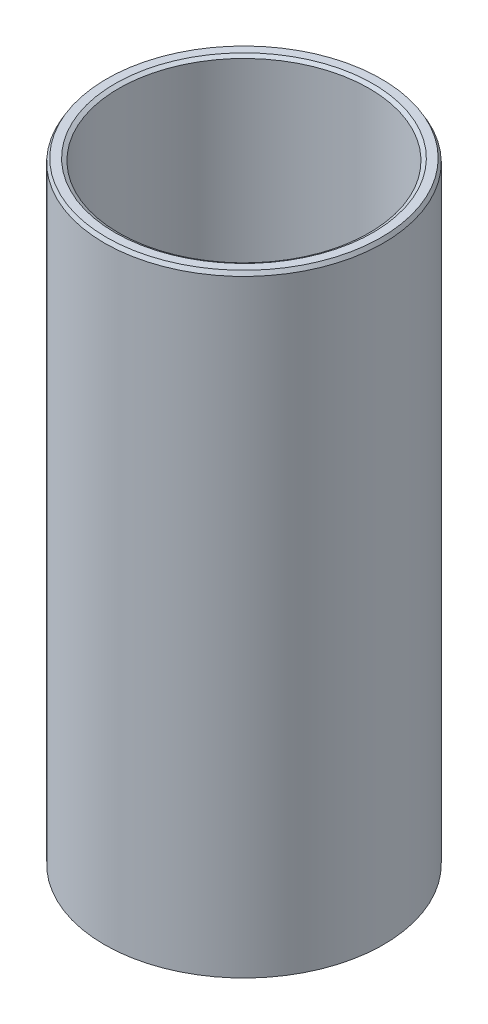
ISO-10303-21;
HEADER;
FILE_DESCRIPTION(('STEP AP214'),'2;1');
FILE_NAME('part.step','',(''),(''),'','','');
FILE_SCHEMA(('AUTOMOTIVE_DESIGN { 1 0 10303 214 1 1 1 1 }'));
ENDSEC;
DATA;
#1=APPLICATION_CONTEXT('core data for automotive mechanical design processes');
#2=APPLICATION_PROTOCOL_DEFINITION('international standard','automotive_design',2000,#1);
#3=PRODUCT_CONTEXT('',#1,'mechanical');
#4=PRODUCT('Part','Part','',(#3));
#5=PRODUCT_RELATED_PRODUCT_CATEGORY('part','',(#4));
#6=PRODUCT_DEFINITION_FORMATION('','',#4);
#7=PRODUCT_DEFINITION_CONTEXT('part definition',#1,'design');
#8=PRODUCT_DEFINITION('design','',#6,#7);
#9=PRODUCT_DEFINITION_SHAPE('','',#8);
#10=(LENGTH_UNIT() NAMED_UNIT(*) SI_UNIT(.MILLI.,.METRE.));
#11=(NAMED_UNIT(*) PLANE_ANGLE_UNIT() SI_UNIT($,.RADIAN.));
#12=(NAMED_UNIT(*) SI_UNIT($,.STERADIAN.) SOLID_ANGLE_UNIT());
#13=UNCERTAINTY_MEASURE_WITH_UNIT(LENGTH_MEASURE(1.E-05),#10,'distance_accuracy_value','');
#14=(GEOMETRIC_REPRESENTATION_CONTEXT(3) GLOBAL_UNCERTAINTY_ASSIGNED_CONTEXT((#13)) GLOBAL_UNIT_ASSIGNED_CONTEXT((#10,
#11,#12)) REPRESENTATION_CONTEXT('',''));
#15=CARTESIAN_POINT('',(0.,0.,0.));
#16=DIRECTION('',(0.,0.,1.));
#17=DIRECTION('',(1.,0.,0.));
#18=AXIS2_PLACEMENT_3D('',#15,#16,#17);
#19=CARTESIAN_POINT('',(0.,219.86373362812,0.));
#20=DIRECTION('',(0.,-1.,0.));
#21=DIRECTION('',(0.,0.,-1.));
#22=AXIS2_PLACEMENT_3D('',#19,#20,#21);
#23=CYLINDRICAL_SURFACE('',#22,50.);
#24=CARTESIAN_POINT('',(0.,0.782832684059431,0.));
#25=DIRECTION('',(0.,1.,0.));
#26=DIRECTION('',(0.,0.,1.));
#27=AXIS2_PLACEMENT_3D('',#24,#25,#26);
#28=CIRCLE('',#27,50.);
#29=CARTESIAN_POINT('',(0.,0.782832684059431,50.));
#30=VERTEX_POINT('',#29);
#31=EDGE_CURVE('E10',#30,#30,#28,.T.);
#32=ORIENTED_EDGE('',*,*,#31,.T.);
#33=EDGE_LOOP('',(#32));
#34=FACE_BOUND('',#33,.T.);
#35=CARTESIAN_POINT('',(0.,218.507827645504,0.));
#36=DIRECTION('',(0.,1.,0.));
#37=DIRECTION('',(0.,0.,1.));
#38=AXIS2_PLACEMENT_3D('',#35,#36,#37);
#39=CIRCLE('',#38,50.);
#40=CARTESIAN_POINT('',(0.,218.507827645504,50.));
#41=VERTEX_POINT('',#40);
#42=EDGE_CURVE('E50',#41,#41,#39,.F.);
#43=ORIENTED_EDGE('',*,*,#42,.T.);
#44=EDGE_LOOP('',(#43));
#45=FACE_BOUND('',#44,.T.);
#46=ADVANCED_FACE('F39',(#34,#45),#23,.T.);
#47=CARTESIAN_POINT('',(0.,219.86373362812,0.));
#48=DIRECTION('',(0.,1.,0.));
#49=DIRECTION('',(0.,0.,1.));
#50=AXIS2_PLACEMENT_3D('',#47,#48,#49);
#51=PLANE('',#50);
#52=CARTESIAN_POINT('',(0.,219.86373362812,0.));
#53=DIRECTION('',(0.,1.,0.));
#54=DIRECTION('',(0.,0.,1.));
#55=AXIS2_PLACEMENT_3D('',#52,#53,#54);
#56=CIRCLE('',#55,46.2211691795901);
#57=CARTESIAN_POINT('',(0.,219.86373362812,46.2211691795901));
#58=VERTEX_POINT('',#57);
#59=EDGE_CURVE('E58',#58,#58,#56,.F.);
#60=ORIENTED_EDGE('',*,*,#59,.T.);
#61=EDGE_LOOP('',(#60));
#62=FACE_BOUND('',#61,.T.);
#63=CARTESIAN_POINT('',(0.,219.86373362812,0.));
#64=DIRECTION('',(0.,1.,0.));
#65=DIRECTION('',(0.,0.,1.));
#66=AXIS2_PLACEMENT_3D('',#63,#64,#65);
#67=CIRCLE('',#66,49.2171673159406);
#68=CARTESIAN_POINT('',(0.,219.86373362812,49.2171673159406));
#69=VERTEX_POINT('',#68);
#70=EDGE_CURVE('E61',#69,#69,#67,.T.);
#71=ORIENTED_EDGE('',*,*,#70,.T.);
#72=EDGE_LOOP('',(#71));
#73=FACE_BOUND('',#72,.T.);
#74=ADVANCED_FACE('F88',(#62,#73),#51,.T.);
#75=CARTESIAN_POINT('',(0.,0.,0.));
#76=DIRECTION('',(0.,1.,0.));
#77=DIRECTION('',(0.,0.,1.));
#78=AXIS2_PLACEMENT_3D('',#75,#76,#77);
#79=PLANE('',#78);
#80=CARTESIAN_POINT('',(0.,0.,0.));
#81=DIRECTION('',(0.,1.,0.));
#82=DIRECTION('',(0.,0.,1.));
#83=AXIS2_PLACEMENT_3D('',#80,#81,#82);
#84=CIRCLE('',#83,45.6480958810332);
#85=CARTESIAN_POINT('',(0.,0.,-45.6480958810332));
#86=VERTEX_POINT('',#85);
#87=EDGE_CURVE('E51',#86,#86,#84,.T.);
#88=ORIENTED_EDGE('',*,*,#87,.T.);
#89=EDGE_LOOP('',(#88));
#90=FACE_BOUND('',#89,.T.);
#91=CARTESIAN_POINT('',(0.,0.,0.));
#92=DIRECTION('',(0.,1.,0.));
#93=DIRECTION('',(0.,0.,1.));
#94=AXIS2_PLACEMENT_3D('',#91,#92,#93);
#95=CIRCLE('',#94,48.6440940173836);
#96=CARTESIAN_POINT('',(0.,0.,48.6440940173836));
#97=VERTEX_POINT('',#96);
#98=EDGE_CURVE('E54',#97,#97,#95,.F.);
#99=ORIENTED_EDGE('',*,*,#98,.T.);
#100=EDGE_LOOP('',(#99));
#101=FACE_BOUND('',#100,.T.);
#102=ADVANCED_FACE('F83',(#90,#101),#79,.F.);
#103=CARTESIAN_POINT('',(0.,219.86373362812,0.));
#104=DIRECTION('',(0.,-1.,0.));
#105=DIRECTION('',(0.,0.,-1.));
#106=AXIS2_PLACEMENT_3D('',#103,#104,#105);
#107=CYLINDRICAL_SURFACE('',#106,44.8652631969738);
#108=CARTESIAN_POINT('',(0.,219.080900944061,0.));
#109=DIRECTION('',(0.,1.,0.));
#110=DIRECTION('',(0.,0.,1.));
#111=AXIS2_PLACEMENT_3D('',#108,#109,#110);
#112=CIRCLE('',#111,44.8652631969738);
#113=CARTESIAN_POINT('',(0.,219.080900944061,44.8652631969738));
#114=VERTEX_POINT('',#113);
#115=EDGE_CURVE('E67',#114,#114,#112,.T.);
#116=ORIENTED_EDGE('',*,*,#115,.T.);
#117=EDGE_LOOP('',(#116));
#118=FACE_BOUND('',#117,.T.);
#119=CARTESIAN_POINT('',(0.,1.35590598261637,0.));
#120=DIRECTION('',(0.,1.,0.));
#121=DIRECTION('',(0.,0.,1.));
#122=AXIS2_PLACEMENT_3D('',#119,#120,#121);
#123=CIRCLE('',#122,44.8652631969738);
#124=CARTESIAN_POINT('',(0.,1.35590598261637,-44.8652631969738));
#125=VERTEX_POINT('',#124);
#126=EDGE_CURVE('E69',#125,#125,#123,.F.);
#127=ORIENTED_EDGE('',*,*,#126,.T.);
#128=EDGE_LOOP('',(#127));
#129=FACE_BOUND('',#128,.T.);
#130=ADVANCED_FACE('F71',(#118,#129),#107,.F.);
#131=CARTESIAN_POINT('',(0.,219.080900944061,0.));
#132=DIRECTION('',(0.,1.,0.));
#133=DIRECTION('',(0.,0.,1.));
#134=AXIS2_PLACEMENT_3D('',#131,#132,#133);
#135=CONICAL_SURFACE('',#134,44.8652631969738,1.04719755119659);
#136=ORIENTED_EDGE('',*,*,#59,.F.);
#137=EDGE_LOOP('',(#136));
#138=FACE_BOUND('',#137,.T.);
#139=ORIENTED_EDGE('',*,*,#115,.F.);
#140=EDGE_LOOP('',(#139));
#141=FACE_BOUND('',#140,.T.);
#142=ADVANCED_FACE('F77',(#138,#141),#135,.F.);
#143=CARTESIAN_POINT('',(0.,0.,0.));
#144=DIRECTION('',(0.,-1.,0.));
#145=DIRECTION('',(0.,0.,-1.));
#146=AXIS2_PLACEMENT_3D('',#143,#144,#145);
#147=CONICAL_SURFACE('',#146,45.6480958810332,0.523598775598298);
#148=CARTESIAN_POINT('',(0.,1.35590598261637,-44.8652631969738));
#149=CARTESIAN_POINT('',(0.,1.34178196196411,-44.8734177040994));
#150=CARTESIAN_POINT('',(0.,1.32765794131186,-44.881572211225));
#151=CARTESIAN_POINT('',(0.,1.29940990000735,-44.8978812254763));
#152=CARTESIAN_POINT('',(0.,1.2852858793551,-44.9060357326019));
#153=CARTESIAN_POINT('',(0.,1.25703783805059,-44.9223447468531));
#154=CARTESIAN_POINT('',(0.,1.24291381739834,-44.9304992539787));
#155=CARTESIAN_POINT('',(0.,1.21466577609383,-44.94680826823));
#156=CARTESIAN_POINT('',(0.,1.20054175544158,-44.9549627753556));
#157=CARTESIAN_POINT('',(0.,1.17229371413707,-44.9712717896068));
#158=CARTESIAN_POINT('',(0.,1.15816969348481,-44.9794262967325));
#159=CARTESIAN_POINT('',(0.,1.12992165218031,-44.9957353109837));
#160=CARTESIAN_POINT('',(0.,1.11579763152805,-45.0038898181093));
#161=CARTESIAN_POINT('',(0.,1.08754959022355,-45.0201988323606));
#162=CARTESIAN_POINT('',(0.,1.07342556957129,-45.0283533394862));
#163=CARTESIAN_POINT('',(0.,1.04517752826678,-45.0446623537374));
#164=CARTESIAN_POINT('',(0.,1.03105350761453,-45.052816860863));
#165=CARTESIAN_POINT('',(0.,1.00280546631002,-45.0691258751143));
#166=CARTESIAN_POINT('',(0.,0.988681445657768,-45.0772803822399));
#167=CARTESIAN_POINT('',(0.,0.960433404353261,-45.0935893964911));
#168=CARTESIAN_POINT('',(0.,0.946309383701007,-45.1017439036167));
#169=CARTESIAN_POINT('',(0.,0.918061342396499,-45.118052917868));
#170=CARTESIAN_POINT('',(0.,0.903937321744245,-45.1262074249936));
#171=CARTESIAN_POINT('',(0.,0.875689280439737,-45.1425164392448));
#172=CARTESIAN_POINT('',(0.,0.861565259787483,-45.1506709463704));
#173=CARTESIAN_POINT('',(0.,0.833317218482975,-45.1669799606217));
#174=CARTESIAN_POINT('',(0.,0.819193197830722,-45.1751344677473));
#175=CARTESIAN_POINT('',(0.,0.790945156526215,-45.1914434819985));
#176=CARTESIAN_POINT('',(0.,0.776821135873961,-45.1995979891242));
#177=CARTESIAN_POINT('',(0.,0.748573094569453,-45.2159070033754));
#178=CARTESIAN_POINT('',(0.,0.734449073917198,-45.224061510501));
#179=CARTESIAN_POINT('',(0.,0.706201032612691,-45.2403705247523));
#180=CARTESIAN_POINT('',(0.,0.692077011960438,-45.2485250318779));
#181=CARTESIAN_POINT('',(0.,0.66382897065593,-45.2648340461291));
#182=CARTESIAN_POINT('',(0.,0.649704950003676,-45.2729885532547));
#183=CARTESIAN_POINT('',(0.,0.621456908699168,-45.289297567506));
#184=CARTESIAN_POINT('',(0.,0.607332888046915,-45.2974520746316));
#185=CARTESIAN_POINT('',(0.,0.579084846742407,-45.3137610888828));
#186=CARTESIAN_POINT('',(0.,0.564960826090153,-45.3219155960084));
#187=CARTESIAN_POINT('',(0.,0.536712784785645,-45.3382246102597));
#188=CARTESIAN_POINT('',(0.,0.522588764133392,-45.3463791173853));
#189=CARTESIAN_POINT('',(0.,0.494340722828885,-45.3626881316365));
#190=CARTESIAN_POINT('',(0.,0.48021670217663,-45.3708426387621));
#191=CARTESIAN_POINT('',(0.,0.451968660872122,-45.3871516530134));
#192=CARTESIAN_POINT('',(0.,0.437844640219869,-45.395306160139));
#193=CARTESIAN_POINT('',(0.,0.409596598915361,-45.4116151743902));
#194=CARTESIAN_POINT('',(0.,0.395472578263107,-45.4197696815159));
#195=CARTESIAN_POINT('',(0.,0.367224536958599,-45.4360786957671));
#196=CARTESIAN_POINT('',(0.,0.353100516306346,-45.4442332028927));
#197=CARTESIAN_POINT('',(0.,0.324852475001839,-45.460542217144));
#198=CARTESIAN_POINT('',(0.,0.310728454349585,-45.4686967242696));
#199=CARTESIAN_POINT('',(0.,0.282480413045076,-45.4850057385208));
#200=CARTESIAN_POINT('',(0.,0.268356392392822,-45.4931602456464));
#201=CARTESIAN_POINT('',(0.,0.240108351088315,-45.5094692598977));
#202=CARTESIAN_POINT('',(0.,0.225984330436062,-45.5176237670233));
#203=CARTESIAN_POINT('',(0.,0.197736289131554,-45.5339327812745));
#204=CARTESIAN_POINT('',(0.,0.1836122684793,-45.5420872884001));
#205=CARTESIAN_POINT('',(0.,0.155364227174792,-45.5583963026514));
#206=CARTESIAN_POINT('',(0.,0.141240206522538,-45.566550809777));
#207=CARTESIAN_POINT('',(0.,0.112992165218031,-45.5828598240282));
#208=CARTESIAN_POINT('',(0.,0.0988681445657763,-45.5910143311538));
#209=CARTESIAN_POINT('',(0.,0.0706201032612687,-45.6073233454051));
#210=CARTESIAN_POINT('',(0.,0.0564960826090153,-45.6154778525307));
#211=CARTESIAN_POINT('',(0.,0.0282480413045086,-45.6317868667819));
#212=CARTESIAN_POINT('',(0.,0.0141240206522553,-45.6399413739076));
#213=CARTESIAN_POINT('',(0.,0.,-45.6480958810332));
#214=B_SPLINE_CURVE_WITH_KNOTS('',3,(#148,#149,#150,#151,#152,#153,#154,#155,#156,#157,#158,
#159,#160,#161,#162,#163,#164,#165,#166,#167,#168,#169,#170,#171,#172,#173,#174,#175,#176,#177,
#178,#179,#180,#181,#182,#183,#184,#185,#186,#187,#188,#189,#190,#191,#192,#193,#194,#195,#196,
#197,#198,#199,#200,#201,#202,#203,#204,#205,#206,#207,#208,#209,#210,#211,#212,#213),
.UNSPECIFIED.,.F.,.F.,(4,2,2,2,2,2,2,2,2,2,2,2,2,2,2,2,2,2,2,2,2,2,2,2,2,2,2,2,2,2,2,2,4),(0.,
0.0489270427537105,0.0978540855074245,0.146781128261135,0.195708171014845,0.244635213768556,
0.29356225652227,0.34248929927598,0.391416342029691,0.440343384783405,0.489270427537115,
0.538197470290826,0.587124513044536,0.63605155579825,0.684978598551961,0.733905641305671,
0.782832684059386,0.831759726813096,0.880686769566807,0.929613812320517,0.978540855074231,
1.02746789782794,1.07639494058165,1.12532198333536,1.17424902608908,1.22317606884279,
1.2721031115965,1.32103015435021,1.36995719710392,1.41888423985763,1.46781128261134,
1.51673832536506,1.56566536811877),.UNSPECIFIED.);
#215=EDGE_CURVE('BSEAM73',#125,#86,#214,.T.);
#216=ORIENTED_EDGE('',*,*,#126,.F.);
#217=ORIENTED_EDGE('',*,*,#87,.F.);
#218=ORIENTED_EDGE('',*,*,#215,.T.);
#219=ORIENTED_EDGE('',*,*,#215,.F.);
#220=EDGE_LOOP('',(#216,#218,#217,#219));
#221=FACE_BOUND('',#220,.T.);
#222=ADVANCED_FACE('F73',(#221),#147,.F.);
#223=CARTESIAN_POINT('',(0.,0.782832684059431,0.));
#224=DIRECTION('',(0.,1.,0.));
#225=DIRECTION('',(0.,0.,1.));
#226=AXIS2_PLACEMENT_3D('',#223,#224,#225);
#227=CONICAL_SURFACE('',#226,50.,1.04719755119659);
#228=ORIENTED_EDGE('',*,*,#98,.F.);
#229=EDGE_LOOP('',(#228));
#230=FACE_BOUND('',#229,.T.);
#231=ORIENTED_EDGE('',*,*,#31,.F.);
#232=EDGE_LOOP('',(#231));
#233=FACE_BOUND('',#232,.T.);
#234=ADVANCED_FACE('F76',(#230,#233),#227,.T.);
#235=CARTESIAN_POINT('',(0.,219.86373362812,0.));
#236=DIRECTION('',(0.,-1.,0.));
#237=DIRECTION('',(0.,0.,-1.));
#238=AXIS2_PLACEMENT_3D('',#235,#236,#237);
#239=CONICAL_SURFACE('',#238,49.2171673159406,0.5235987755983);
#240=ORIENTED_EDGE('',*,*,#42,.F.);
#241=EDGE_LOOP('',(#240));
#242=FACE_BOUND('',#241,.T.);
#243=ORIENTED_EDGE('',*,*,#70,.F.);
#244=EDGE_LOOP('',(#243));
#245=FACE_BOUND('',#244,.T.);
#246=ADVANCED_FACE('F45',(#242,#245),#239,.T.);
#247=CLOSED_SHELL('',(#46,#74,#102,#130,#142,#222,#234,#246));
#248=MANIFOLD_SOLID_BREP('B2',#247);
#249=ADVANCED_BREP_SHAPE_REPRESENTATION('',(#18,#248),#14);
#250=SHAPE_DEFINITION_REPRESENTATION(#9,#249);
ENDSEC;
END-ISO-10303-21;
